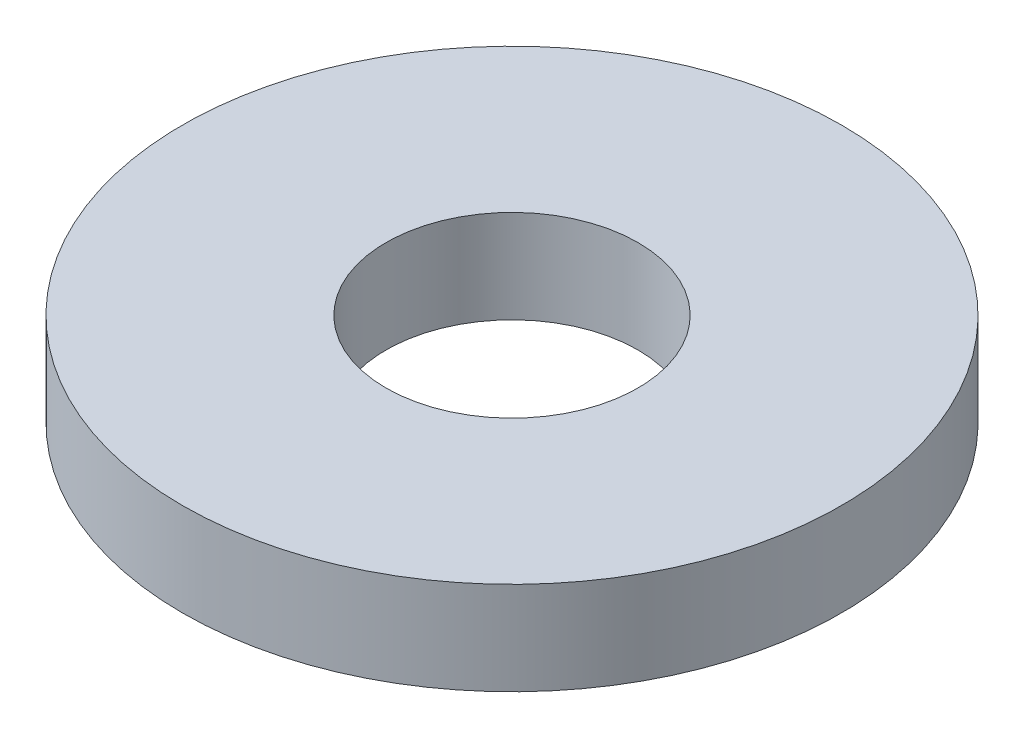
ISO-10303-21;
HEADER;
FILE_DESCRIPTION(('STEP AP214'),'2;1');
FILE_NAME('part.step','',(''),(''),'','','');
FILE_SCHEMA(('AUTOMOTIVE_DESIGN { 1 0 10303 214 1 1 1 1 }'));
ENDSEC;
DATA;
#1=APPLICATION_CONTEXT('core data for automotive mechanical design processes');
#2=APPLICATION_PROTOCOL_DEFINITION('international standard','automotive_design',2000,#1);
#3=PRODUCT_CONTEXT('',#1,'mechanical');
#4=PRODUCT('Part','Part','',(#3));
#5=PRODUCT_RELATED_PRODUCT_CATEGORY('part','',(#4));
#6=PRODUCT_DEFINITION_FORMATION('','',#4);
#7=PRODUCT_DEFINITION_CONTEXT('part definition',#1,'design');
#8=PRODUCT_DEFINITION('design','',#6,#7);
#9=PRODUCT_DEFINITION_SHAPE('','',#8);
#10=(LENGTH_UNIT() NAMED_UNIT(*) SI_UNIT(.MILLI.,.METRE.));
#11=(NAMED_UNIT(*) PLANE_ANGLE_UNIT() SI_UNIT($,.RADIAN.));
#12=(NAMED_UNIT(*) SI_UNIT($,.STERADIAN.) SOLID_ANGLE_UNIT());
#13=UNCERTAINTY_MEASURE_WITH_UNIT(LENGTH_MEASURE(1.E-05),#10,'distance_accuracy_value','');
#14=(GEOMETRIC_REPRESENTATION_CONTEXT(3) GLOBAL_UNCERTAINTY_ASSIGNED_CONTEXT((#13)) GLOBAL_UNIT_ASSIGNED_CONTEXT((#10,
#11,#12)) REPRESENTATION_CONTEXT('',''));
#15=CARTESIAN_POINT('',(0.,0.,0.));
#16=DIRECTION('',(0.,0.,1.));
#17=DIRECTION('',(1.,0.,0.));
#18=AXIS2_PLACEMENT_3D('',#15,#16,#17);
#19=CARTESIAN_POINT('',(0.,24.,0.));
#20=DIRECTION('',(0.,-1.,0.));
#21=DIRECTION('',(0.,0.,-1.));
#22=AXIS2_PLACEMENT_3D('',#19,#20,#21);
#23=CYLINDRICAL_SURFACE('',#22,85.);
#24=CARTESIAN_POINT('',(0.,24.,0.));
#25=DIRECTION('',(0.,1.,0.));
#26=DIRECTION('',(0.,0.,1.));
#27=AXIS2_PLACEMENT_3D('',#24,#25,#26);
#28=CIRCLE('',#27,85.);
#29=CARTESIAN_POINT('',(0.,24.,85.));
#30=VERTEX_POINT('',#29);
#31=EDGE_CURVE('E10',#30,#30,#28,.T.);
#32=ORIENTED_EDGE('',*,*,#31,.F.);
#33=EDGE_LOOP('',(#32));
#34=FACE_BOUND('',#33,.T.);
#35=CARTESIAN_POINT('',(0.,0.,0.));
#36=DIRECTION('',(0.,1.,0.));
#37=DIRECTION('',(0.,0.,1.));
#38=AXIS2_PLACEMENT_3D('',#35,#36,#37);
#39=CIRCLE('',#38,85.);
#40=CARTESIAN_POINT('',(0.,0.,85.));
#41=VERTEX_POINT('',#40);
#42=EDGE_CURVE('E37',#41,#41,#39,.T.);
#43=ORIENTED_EDGE('',*,*,#42,.T.);
#44=EDGE_LOOP('',(#43));
#45=FACE_BOUND('',#44,.T.);
#46=ADVANCED_FACE('F40',(#34,#45),#23,.T.);
#47=CARTESIAN_POINT('',(0.,24.,0.));
#48=DIRECTION('',(0.,1.,0.));
#49=DIRECTION('',(0.,0.,1.));
#50=AXIS2_PLACEMENT_3D('',#47,#48,#49);
#51=PLANE('',#50);
#52=CARTESIAN_POINT('',(0.,24.,0.));
#53=DIRECTION('',(0.,1.,0.));
#54=DIRECTION('',(0.,0.,1.));
#55=AXIS2_PLACEMENT_3D('',#52,#53,#54);
#56=CIRCLE('',#55,32.5);
#57=CARTESIAN_POINT('',(0.,24.,32.5));
#58=VERTEX_POINT('',#57);
#59=EDGE_CURVE('E50',#58,#58,#56,.T.);
#60=ORIENTED_EDGE('',*,*,#59,.F.);
#61=EDGE_LOOP('',(#60));
#62=FACE_BOUND('',#61,.T.);
#63=ORIENTED_EDGE('',*,*,#31,.T.);
#64=EDGE_LOOP('',(#63));
#65=FACE_BOUND('',#64,.T.);
#66=ADVANCED_FACE('F59',(#62,#65),#51,.T.);
#67=CARTESIAN_POINT('',(0.,0.,0.));
#68=DIRECTION('',(0.,1.,0.));
#69=DIRECTION('',(0.,0.,1.));
#70=AXIS2_PLACEMENT_3D('',#67,#68,#69);
#71=PLANE('',#70);
#72=CARTESIAN_POINT('',(0.,0.,0.));
#73=DIRECTION('',(0.,1.,0.));
#74=DIRECTION('',(0.,0.,1.));
#75=AXIS2_PLACEMENT_3D('',#72,#73,#74);
#76=CIRCLE('',#75,32.5);
#77=CARTESIAN_POINT('',(0.,0.,32.5));
#78=VERTEX_POINT('',#77);
#79=EDGE_CURVE('E47',#78,#78,#76,.T.);
#80=ORIENTED_EDGE('',*,*,#79,.T.);
#81=EDGE_LOOP('',(#80));
#82=FACE_BOUND('',#81,.T.);
#83=ORIENTED_EDGE('',*,*,#42,.F.);
#84=EDGE_LOOP('',(#83));
#85=FACE_BOUND('',#84,.T.);
#86=ADVANCED_FACE('F58',(#82,#85),#71,.F.);
#87=CARTESIAN_POINT('',(0.,24.,0.));
#88=DIRECTION('',(0.,-1.,0.));
#89=DIRECTION('',(0.,0.,-1.));
#90=AXIS2_PLACEMENT_3D('',#87,#88,#89);
#91=CYLINDRICAL_SURFACE('',#90,32.5);
#92=ORIENTED_EDGE('',*,*,#59,.T.);
#93=EDGE_LOOP('',(#92));
#94=FACE_BOUND('',#93,.T.);
#95=ORIENTED_EDGE('',*,*,#79,.F.);
#96=EDGE_LOOP('',(#95));
#97=FACE_BOUND('',#96,.T.);
#98=ADVANCED_FACE('F54',(#94,#97),#91,.F.);
#99=CLOSED_SHELL('',(#46,#66,#86,#98));
#100=MANIFOLD_SOLID_BREP('B2',#99);
#101=ADVANCED_BREP_SHAPE_REPRESENTATION('',(#18,#100),#14);
#102=SHAPE_DEFINITION_REPRESENTATION(#9,#101);
ENDSEC;
END-ISO-10303-21;
